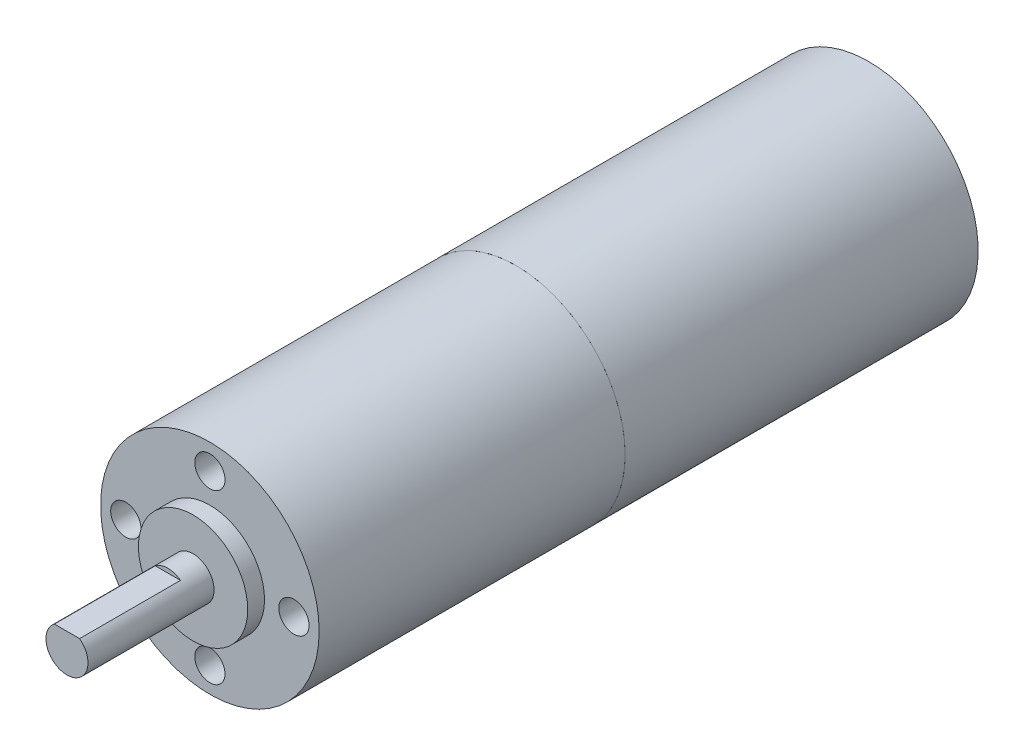
ISO-10303-21;
HEADER;
FILE_DESCRIPTION(('STEP AP214'),'2;1');
FILE_NAME('part.step','',(''),(''),'','','');
FILE_SCHEMA(('AUTOMOTIVE_DESIGN { 1 0 10303 214 1 1 1 1 }'));
ENDSEC;
DATA;
#1=APPLICATION_CONTEXT('core data for automotive mechanical design processes');
#2=APPLICATION_PROTOCOL_DEFINITION('international standard','automotive_design',2000,#1);
#3=PRODUCT_CONTEXT('',#1,'mechanical');
#4=PRODUCT('Part','Part','',(#3));
#5=PRODUCT_RELATED_PRODUCT_CATEGORY('part','',(#4));
#6=PRODUCT_DEFINITION_FORMATION('','',#4);
#7=PRODUCT_DEFINITION_CONTEXT('part definition',#1,'design');
#8=PRODUCT_DEFINITION('design','',#6,#7);
#9=PRODUCT_DEFINITION_SHAPE('','',#8);
#10=(LENGTH_UNIT() NAMED_UNIT(*) SI_UNIT(.MILLI.,.METRE.));
#11=(NAMED_UNIT(*) PLANE_ANGLE_UNIT() SI_UNIT($,.RADIAN.));
#12=(NAMED_UNIT(*) SI_UNIT($,.STERADIAN.) SOLID_ANGLE_UNIT());
#13=UNCERTAINTY_MEASURE_WITH_UNIT(LENGTH_MEASURE(1.E-05),#10,'distance_accuracy_value','');
#14=(GEOMETRIC_REPRESENTATION_CONTEXT(3) GLOBAL_UNCERTAINTY_ASSIGNED_CONTEXT((#13)) GLOBAL_UNIT_ASSIGNED_CONTEXT((#10,
#11,#12)) REPRESENTATION_CONTEXT('',''));
#15=CARTESIAN_POINT('',(0.,0.,0.));
#16=DIRECTION('',(0.,0.,1.));
#17=DIRECTION('',(1.,0.,0.));
#18=AXIS2_PLACEMENT_3D('',#15,#16,#17);
#19=CARTESIAN_POINT('',(0.,0.,-42.));
#20=DIRECTION('',(0.,0.,1.));
#21=DIRECTION('',(1.,0.,0.));
#22=AXIS2_PLACEMENT_3D('',#19,#20,#21);
#23=CYLINDRICAL_SURFACE('',#22,13.);
#24=CARTESIAN_POINT('',(0.,0.,-42.));
#25=DIRECTION('',(0.,0.,-1.));
#26=DIRECTION('',(-1.,0.,0.));
#27=AXIS2_PLACEMENT_3D('',#24,#25,#26);
#28=CIRCLE('',#27,13.);
#29=CARTESIAN_POINT('',(-13.,0.,-42.));
#30=VERTEX_POINT('',#29);
#31=EDGE_CURVE('E11',#30,#30,#28,.T.);
#32=ORIENTED_EDGE('',*,*,#31,.F.);
#33=EDGE_LOOP('',(#32));
#34=FACE_BOUND('',#33,.T.);
#35=CARTESIAN_POINT('',(0.,0.,0.));
#36=DIRECTION('',(0.,0.,-1.));
#37=DIRECTION('',(-1.,0.,0.));
#38=AXIS2_PLACEMENT_3D('',#35,#36,#37);
#39=CIRCLE('',#38,13.);
#40=CARTESIAN_POINT('',(-13.,0.,0.));
#41=VERTEX_POINT('',#40);
#42=EDGE_CURVE('E46',#41,#41,#39,.T.);
#43=ORIENTED_EDGE('',*,*,#42,.T.);
#44=EDGE_LOOP('',(#43));
#45=FACE_BOUND('',#44,.T.);
#46=ADVANCED_FACE('F43',(#34,#45),#23,.T.);
#47=CARTESIAN_POINT('',(0.,0.,-42.));
#48=DIRECTION('',(0.,0.,-1.));
#49=DIRECTION('',(-1.,0.,0.));
#50=AXIS2_PLACEMENT_3D('',#47,#48,#49);
#51=PLANE('',#50);
#52=ORIENTED_EDGE('',*,*,#31,.T.);
#53=EDGE_LOOP('',(#52));
#54=FACE_BOUND('',#53,.T.);
#55=ADVANCED_FACE('F58',(#54),#51,.T.);
#56=CARTESIAN_POINT('',(0.,0.,0.));
#57=DIRECTION('',(0.,0.,-1.));
#58=DIRECTION('',(-1.,0.,0.));
#59=AXIS2_PLACEMENT_3D('',#56,#57,#58);
#60=PLANE('',#59);
#61=ORIENTED_EDGE('',*,*,#42,.F.);
#62=EDGE_LOOP('',(#61));
#63=FACE_BOUND('',#62,.T.);
#64=ADVANCED_FACE('F56',(#63),#60,.F.);
#65=CLOSED_SHELL('',(#46,#55,#64));
#66=MANIFOLD_SOLID_BREP('B2',#65);
#67=CARTESIAN_POINT('',(0.,0.,39.4));
#68=DIRECTION('',(0.,0.,-1.));
#69=DIRECTION('',(-1.,0.,0.));
#70=AXIS2_PLACEMENT_3D('',#67,#68,#69);
#71=CYLINDRICAL_SURFACE('',#70,2.49680534345229);
#72=CARTESIAN_POINT('',(0.,0.,39.4));
#73=DIRECTION('',(0.,0.,1.));
#74=DIRECTION('',(1.,0.,0.));
#75=AXIS2_PLACEMENT_3D('',#72,#73,#74);
#76=CIRCLE('',#75,2.49680534345229);
#77=CARTESIAN_POINT('',(2.49680534345229,0.,39.4));
#78=VERTEX_POINT('',#77);
#79=EDGE_CURVE('E42',#78,#78,#76,.T.);
#80=ORIENTED_EDGE('',*,*,#79,.F.);
#81=EDGE_LOOP('',(#80));
#82=FACE_BOUND('',#81,.T.);
#83=CARTESIAN_POINT('',(0.,0.,36.4));
#84=DIRECTION('',(0.,0.,1.));
#85=DIRECTION('',(1.,0.,0.));
#86=AXIS2_PLACEMENT_3D('',#83,#84,#85);
#87=CIRCLE('',#86,2.49680534345229);
#88=CARTESIAN_POINT('',(2.49680534345229,0.,36.4));
#89=VERTEX_POINT('',#88);
#90=EDGE_CURVE('E95',#89,#89,#87,.T.);
#91=ORIENTED_EDGE('',*,*,#90,.T.);
#92=EDGE_LOOP('',(#91));
#93=FACE_BOUND('',#92,.T.);
#94=ADVANCED_FACE('F92',(#82,#93),#71,.T.);
#95=CARTESIAN_POINT('',(0.,0.,39.4));
#96=DIRECTION('',(0.,0.,1.));
#97=DIRECTION('',(1.,0.,0.));
#98=AXIS2_PLACEMENT_3D('',#95,#96,#97);
#99=PLANE('',#98);
#100=ORIENTED_EDGE('',*,*,#79,.T.);
#101=EDGE_LOOP('',(#100));
#102=FACE_BOUND('',#101,.T.);
#103=ADVANCED_FACE('F107',(#102),#99,.T.);
#104=CARTESIAN_POINT('',(0.,0.,36.4));
#105=DIRECTION('',(0.,0.,1.));
#106=DIRECTION('',(1.,0.,0.));
#107=AXIS2_PLACEMENT_3D('',#104,#105,#106);
#108=PLANE('',#107);
#109=ORIENTED_EDGE('',*,*,#90,.F.);
#110=EDGE_LOOP('',(#109));
#111=FACE_BOUND('',#110,.T.);
#112=ADVANCED_FACE('F105',(#111),#108,.F.);
#113=CLOSED_SHELL('',(#94,#103,#112));
#114=MANIFOLD_SOLID_BREP('B6_NOT_SHOWN',#113);
#115=CARTESIAN_POINT('',(0.,0.,36.4));
#116=DIRECTION('',(0.,0.,1.));
#117=DIRECTION('',(1.,0.,0.));
#118=AXIS2_PLACEMENT_3D('',#115,#116,#117);
#119=PLANE('',#118);
#120=CARTESIAN_POINT('',(0.,10.,36.4));
#121=DIRECTION('',(0.,0.,1.));
#122=DIRECTION('',(1.,0.,0.));
#123=AXIS2_PLACEMENT_3D('',#120,#121,#122);
#124=CIRCLE('',#123,1.8);
#125=CARTESIAN_POINT('',(1.8,10.,36.4));
#126=VERTEX_POINT('',#125);
#127=EDGE_CURVE('E204',#126,#126,#124,.T.);
#128=ORIENTED_EDGE('',*,*,#127,.F.);
#129=EDGE_LOOP('',(#128));
#130=FACE_BOUND('',#129,.T.);
#131=CARTESIAN_POINT('',(-10.,0.,36.4));
#132=DIRECTION('',(0.,0.,1.));
#133=DIRECTION('',(1.,0.,0.));
#134=AXIS2_PLACEMENT_3D('',#131,#132,#133);
#135=CIRCLE('',#134,1.8);
#136=CARTESIAN_POINT('',(-8.2,0.,36.4));
#137=VERTEX_POINT('',#136);
#138=EDGE_CURVE('E198',#137,#137,#135,.T.);
#139=ORIENTED_EDGE('',*,*,#138,.F.);
#140=EDGE_LOOP('',(#139));
#141=FACE_BOUND('',#140,.T.);
#142=CARTESIAN_POINT('',(0.,-10.,36.4));
#143=DIRECTION('',(0.,0.,1.));
#144=DIRECTION('',(1.,0.,0.));
#145=AXIS2_PLACEMENT_3D('',#142,#143,#144);
#146=CIRCLE('',#145,1.8);
#147=CARTESIAN_POINT('',(1.8,-10.,36.4));
#148=VERTEX_POINT('',#147);
#149=EDGE_CURVE('E192',#148,#148,#146,.T.);
#150=ORIENTED_EDGE('',*,*,#149,.F.);
#151=EDGE_LOOP('',(#150));
#152=FACE_BOUND('',#151,.T.);
#153=CARTESIAN_POINT('',(10.,0.,36.4));
#154=DIRECTION('',(0.,0.,1.));
#155=DIRECTION('',(1.,0.,0.));
#156=AXIS2_PLACEMENT_3D('',#153,#154,#155);
#157=CIRCLE('',#156,1.8);
#158=CARTESIAN_POINT('',(11.8,0.,36.4));
#159=VERTEX_POINT('',#158);
#160=EDGE_CURVE('E186',#159,#159,#157,.T.);
#161=ORIENTED_EDGE('',*,*,#160,.F.);
#162=EDGE_LOOP('',(#161));
#163=FACE_BOUND('',#162,.T.);
#164=CARTESIAN_POINT('',(0.,0.,36.4));
#165=DIRECTION('',(0.,0.,1.));
#166=DIRECTION('',(1.,0.,0.));
#167=AXIS2_PLACEMENT_3D('',#164,#165,#166);
#168=CIRCLE('',#167,13.);
#169=CARTESIAN_POINT('',(13.,0.,36.4));
#170=VERTEX_POINT('',#169);
#171=EDGE_CURVE('E90',#170,#170,#168,.T.);
#172=ORIENTED_EDGE('',*,*,#171,.T.);
#173=EDGE_LOOP('',(#172));
#174=FACE_BOUND('',#173,.T.);
#175=CARTESIAN_POINT('',(0.,0.,36.4));
#176=DIRECTION('',(0.,0.,1.));
#177=DIRECTION('',(1.,0.,0.));
#178=AXIS2_PLACEMENT_3D('',#175,#176,#177);
#179=CIRCLE('',#178,6.5);
#180=CARTESIAN_POINT('',(6.5,0.,36.4));
#181=VERTEX_POINT('',#180);
#182=EDGE_CURVE('E177',#181,#181,#179,.T.);
#183=ORIENTED_EDGE('',*,*,#182,.F.);
#184=EDGE_LOOP('',(#183));
#185=FACE_BOUND('',#184,.T.);
#186=ADVANCED_FACE('F132',(#130,#141,#152,#163,#174,#185),#119,.T.);
#187=CARTESIAN_POINT('',(0.,0.,36.4));
#188=DIRECTION('',(0.,0.,-1.));
#189=DIRECTION('',(-1.,0.,0.));
#190=AXIS2_PLACEMENT_3D('',#187,#188,#189);
#191=CYLINDRICAL_SURFACE('',#190,13.);
#192=ORIENTED_EDGE('',*,*,#171,.F.);
#193=EDGE_LOOP('',(#192));
#194=FACE_BOUND('',#193,.T.);
#195=CARTESIAN_POINT('',(0.,0.,0.));
#196=DIRECTION('',(0.,0.,1.));
#197=DIRECTION('',(1.,0.,0.));
#198=AXIS2_PLACEMENT_3D('',#195,#196,#197);
#199=CIRCLE('',#198,13.);
#200=CARTESIAN_POINT('',(13.,0.,0.));
#201=VERTEX_POINT('',#200);
#202=EDGE_CURVE('E136',#201,#201,#199,.T.);
#203=ORIENTED_EDGE('',*,*,#202,.T.);
#204=EDGE_LOOP('',(#203));
#205=FACE_BOUND('',#204,.T.);
#206=ADVANCED_FACE('F134',(#194,#205),#191,.T.);
#207=CARTESIAN_POINT('',(0.,0.,0.));
#208=DIRECTION('',(0.,0.,1.));
#209=DIRECTION('',(1.,0.,0.));
#210=AXIS2_PLACEMENT_3D('',#207,#208,#209);
#211=PLANE('',#210);
#212=ORIENTED_EDGE('',*,*,#202,.F.);
#213=EDGE_LOOP('',(#212));
#214=FACE_BOUND('',#213,.T.);
#215=ADVANCED_FACE('F226',(#214),#211,.F.);
#216=CARTESIAN_POINT('',(0.,0.,38.4));
#217=DIRECTION('',(0.,0.,1.));
#218=DIRECTION('',(1.,0.,0.));
#219=AXIS2_PLACEMENT_3D('',#216,#217,#218);
#220=PLANE('',#219);
#221=CARTESIAN_POINT('',(0.,0.,38.4));
#222=DIRECTION('',(0.,0.,1.));
#223=DIRECTION('',(1.,0.,0.));
#224=AXIS2_PLACEMENT_3D('',#221,#222,#223);
#225=CIRCLE('',#224,6.5);
#226=CARTESIAN_POINT('',(6.5,0.,38.4));
#227=VERTEX_POINT('',#226);
#228=EDGE_CURVE('E173',#227,#227,#225,.T.);
#229=ORIENTED_EDGE('',*,*,#228,.T.);
#230=EDGE_LOOP('',(#229));
#231=FACE_BOUND('',#230,.T.);
#232=CARTESIAN_POINT('',(0.,0.,38.4));
#233=DIRECTION('',(0.,0.,1.));
#234=DIRECTION('',(1.,0.,0.));
#235=AXIS2_PLACEMENT_3D('',#232,#233,#234);
#236=CIRCLE('',#235,2.5);
#237=CARTESIAN_POINT('',(2.5,0.,38.4));
#238=VERTEX_POINT('',#237);
#239=EDGE_CURVE('E181',#238,#238,#236,.T.);
#240=ORIENTED_EDGE('',*,*,#239,.F.);
#241=EDGE_LOOP('',(#240));
#242=FACE_BOUND('',#241,.T.);
#243=ADVANCED_FACE('F233',(#231,#242),#220,.T.);
#244=CARTESIAN_POINT('',(0.,0.,38.4));
#245=DIRECTION('',(0.,0.,-1.));
#246=DIRECTION('',(-1.,0.,0.));
#247=AXIS2_PLACEMENT_3D('',#244,#245,#246);
#248=CYLINDRICAL_SURFACE('',#247,6.5);
#249=ORIENTED_EDGE('',*,*,#228,.F.);
#250=EDGE_LOOP('',(#249));
#251=FACE_BOUND('',#250,.T.);
#252=ORIENTED_EDGE('',*,*,#182,.T.);
#253=EDGE_LOOP('',(#252));
#254=FACE_BOUND('',#253,.T.);
#255=ADVANCED_FACE('F238',(#251,#254),#248,.T.);
#256=CARTESIAN_POINT('',(0.,0.,53.4));
#257=DIRECTION('',(0.,0.,1.));
#258=DIRECTION('',(1.,0.,0.));
#259=AXIS2_PLACEMENT_3D('',#256,#257,#258);
#260=PLANE('',#259);
#261=DIRECTION('',(1.,0.,0.));
#262=VECTOR('',#261,1.);
#263=CARTESIAN_POINT('',(0.,2.,53.4));
#264=LINE('',#263,#262);
#265=CARTESIAN_POINT('',(-1.5,2.,53.4));
#266=VERTEX_POINT('',#265);
#267=CARTESIAN_POINT('',(1.5,2.,53.4));
#268=VERTEX_POINT('',#267);
#269=EDGE_CURVE('E157',#266,#268,#264,.T.);
#270=ORIENTED_EDGE('',*,*,#269,.F.);
#271=CARTESIAN_POINT('',(0.,0.,53.4));
#272=DIRECTION('',(0.,0.,1.));
#273=DIRECTION('',(1.,0.,0.));
#274=AXIS2_PLACEMENT_3D('',#271,#272,#273);
#275=CIRCLE('',#274,2.5);
#276=EDGE_CURVE('E169',#266,#268,#275,.T.);
#277=ORIENTED_EDGE('',*,*,#276,.T.);
#278=EDGE_LOOP('',(#270,#277));
#279=FACE_BOUND('',#278,.T.);
#280=ADVANCED_FACE('F172',(#279),#260,.T.);
#281=CARTESIAN_POINT('',(0.,0.,53.4));
#282=DIRECTION('',(0.,0.,-1.));
#283=DIRECTION('',(-1.,0.,0.));
#284=AXIS2_PLACEMENT_3D('',#281,#282,#283);
#285=CYLINDRICAL_SURFACE('',#284,2.5);
#286=ORIENTED_EDGE('',*,*,#276,.F.);
#287=DIRECTION('',(0.,0.,1.));
#288=VECTOR('',#287,1.);
#289=CARTESIAN_POINT('',(-1.5,2.,41.4));
#290=LINE('',#289,#288);
#291=CARTESIAN_POINT('',(-1.5,2.,41.4));
#292=VERTEX_POINT('',#291);
#293=EDGE_CURVE('E160',#292,#266,#290,.T.);
#294=ORIENTED_EDGE('',*,*,#293,.F.);
#295=CARTESIAN_POINT('',(0.,0.,41.4));
#296=DIRECTION('',(0.,0.,1.));
#297=DIRECTION('',(-1.,0.,0.));
#298=AXIS2_PLACEMENT_3D('',#295,#296,#297);
#299=CIRCLE('',#298,2.5);
#300=CARTESIAN_POINT('',(1.5,2.,41.4));
#301=VERTEX_POINT('',#300);
#302=EDGE_CURVE('E170',#301,#292,#299,.T.);
#303=ORIENTED_EDGE('',*,*,#302,.F.);
#304=DIRECTION('',(0.,0.,1.));
#305=VECTOR('',#304,1.);
#306=CARTESIAN_POINT('',(1.5,2.,41.4));
#307=LINE('',#306,#305);
#308=EDGE_CURVE('E147',#301,#268,#307,.T.);
#309=ORIENTED_EDGE('',*,*,#308,.T.);
#310=EDGE_LOOP('',(#286,#294,#303,#309));
#311=FACE_BOUND('',#310,.T.);
#312=ORIENTED_EDGE('',*,*,#239,.T.);
#313=EDGE_LOOP('',(#312));
#314=FACE_BOUND('',#313,.T.);
#315=ADVANCED_FACE('F167',(#311,#314),#285,.T.);
#316=CARTESIAN_POINT('',(10.,0.,32.4));
#317=DIRECTION('',(0.,0.,1.));
#318=DIRECTION('',(1.,0.,0.));
#319=AXIS2_PLACEMENT_3D('',#316,#317,#318);
#320=CYLINDRICAL_SURFACE('',#319,1.8);
#321=CARTESIAN_POINT('',(10.,0.,32.4));
#322=DIRECTION('',(0.,0.,1.));
#323=DIRECTION('',(1.,0.,0.));
#324=AXIS2_PLACEMENT_3D('',#321,#322,#323);
#325=CIRCLE('',#324,1.8);
#326=CARTESIAN_POINT('',(11.8,0.,32.4));
#327=VERTEX_POINT('',#326);
#328=EDGE_CURVE('E189',#327,#327,#325,.T.);
#329=ORIENTED_EDGE('',*,*,#328,.F.);
#330=EDGE_LOOP('',(#329));
#331=FACE_BOUND('',#330,.T.);
#332=ORIENTED_EDGE('',*,*,#160,.T.);
#333=EDGE_LOOP('',(#332));
#334=FACE_BOUND('',#333,.T.);
#335=ADVANCED_FACE('F250',(#331,#334),#320,.F.);
#336=CARTESIAN_POINT('',(10.,0.,32.4));
#337=DIRECTION('',(0.,0.,1.));
#338=DIRECTION('',(1.,0.,0.));
#339=AXIS2_PLACEMENT_3D('',#336,#337,#338);
#340=PLANE('',#339);
#341=ORIENTED_EDGE('',*,*,#328,.T.);
#342=EDGE_LOOP('',(#341));
#343=FACE_BOUND('',#342,.T.);
#344=ADVANCED_FACE('F259',(#343),#340,.T.);
#345=CARTESIAN_POINT('',(0.,-10.,32.4));
#346=DIRECTION('',(0.,0.,1.));
#347=DIRECTION('',(1.,0.,0.));
#348=AXIS2_PLACEMENT_3D('',#345,#346,#347);
#349=CYLINDRICAL_SURFACE('',#348,1.8);
#350=CARTESIAN_POINT('',(0.,-10.,32.4));
#351=DIRECTION('',(0.,0.,1.));
#352=DIRECTION('',(1.,0.,0.));
#353=AXIS2_PLACEMENT_3D('',#350,#351,#352);
#354=CIRCLE('',#353,1.8);
#355=CARTESIAN_POINT('',(1.8,-10.,32.4));
#356=VERTEX_POINT('',#355);
#357=EDGE_CURVE('E195',#356,#356,#354,.T.);
#358=ORIENTED_EDGE('',*,*,#357,.F.);
#359=EDGE_LOOP('',(#358));
#360=FACE_BOUND('',#359,.T.);
#361=ORIENTED_EDGE('',*,*,#149,.T.);
#362=EDGE_LOOP('',(#361));
#363=FACE_BOUND('',#362,.T.);
#364=ADVANCED_FACE('F264',(#360,#363),#349,.F.);
#365=CARTESIAN_POINT('',(0.,-10.,32.4));
#366=DIRECTION('',(0.,0.,1.));
#367=DIRECTION('',(1.,0.,0.));
#368=AXIS2_PLACEMENT_3D('',#365,#366,#367);
#369=PLANE('',#368);
#370=ORIENTED_EDGE('',*,*,#357,.T.);
#371=EDGE_LOOP('',(#370));
#372=FACE_BOUND('',#371,.T.);
#373=ADVANCED_FACE('F278',(#372),#369,.T.);
#374=CARTESIAN_POINT('',(-10.,0.,32.4));
#375=DIRECTION('',(0.,0.,1.));
#376=DIRECTION('',(1.,0.,0.));
#377=AXIS2_PLACEMENT_3D('',#374,#375,#376);
#378=CYLINDRICAL_SURFACE('',#377,1.8);
#379=CARTESIAN_POINT('',(-10.,0.,32.4));
#380=DIRECTION('',(0.,0.,1.));
#381=DIRECTION('',(1.,0.,0.));
#382=AXIS2_PLACEMENT_3D('',#379,#380,#381);
#383=CIRCLE('',#382,1.8);
#384=CARTESIAN_POINT('',(-8.2,0.,32.4));
#385=VERTEX_POINT('',#384);
#386=EDGE_CURVE('E201',#385,#385,#383,.T.);
#387=ORIENTED_EDGE('',*,*,#386,.F.);
#388=EDGE_LOOP('',(#387));
#389=FACE_BOUND('',#388,.T.);
#390=ORIENTED_EDGE('',*,*,#138,.T.);
#391=EDGE_LOOP('',(#390));
#392=FACE_BOUND('',#391,.T.);
#393=ADVANCED_FACE('F284',(#389,#392),#378,.F.);
#394=CARTESIAN_POINT('',(-10.,0.,32.4));
#395=DIRECTION('',(0.,0.,1.));
#396=DIRECTION('',(1.,0.,0.));
#397=AXIS2_PLACEMENT_3D('',#394,#395,#396);
#398=PLANE('',#397);
#399=ORIENTED_EDGE('',*,*,#386,.T.);
#400=EDGE_LOOP('',(#399));
#401=FACE_BOUND('',#400,.T.);
#402=ADVANCED_FACE('F288',(#401),#398,.T.);
#403=CARTESIAN_POINT('',(0.,10.,32.4));
#404=DIRECTION('',(0.,0.,1.));
#405=DIRECTION('',(1.,0.,0.));
#406=AXIS2_PLACEMENT_3D('',#403,#404,#405);
#407=CYLINDRICAL_SURFACE('',#406,1.8);
#408=CARTESIAN_POINT('',(0.,10.,32.4));
#409=DIRECTION('',(0.,0.,1.));
#410=DIRECTION('',(1.,0.,0.));
#411=AXIS2_PLACEMENT_3D('',#408,#409,#410);
#412=CIRCLE('',#411,1.8);
#413=CARTESIAN_POINT('',(1.8,10.,32.4));
#414=VERTEX_POINT('',#413);
#415=EDGE_CURVE('E185',#414,#414,#412,.T.);
#416=ORIENTED_EDGE('',*,*,#415,.F.);
#417=EDGE_LOOP('',(#416));
#418=FACE_BOUND('',#417,.T.);
#419=ORIENTED_EDGE('',*,*,#127,.T.);
#420=EDGE_LOOP('',(#419));
#421=FACE_BOUND('',#420,.T.);
#422=ADVANCED_FACE('F292',(#418,#421),#407,.F.);
#423=CARTESIAN_POINT('',(0.,10.,32.4));
#424=DIRECTION('',(0.,0.,1.));
#425=DIRECTION('',(1.,0.,0.));
#426=AXIS2_PLACEMENT_3D('',#423,#424,#425);
#427=PLANE('',#426);
#428=ORIENTED_EDGE('',*,*,#415,.T.);
#429=EDGE_LOOP('',(#428));
#430=FACE_BOUND('',#429,.T.);
#431=ADVANCED_FACE('F218',(#430),#427,.T.);
#432=CARTESIAN_POINT('',(0.,2.,41.4));
#433=DIRECTION('',(0.,-1.,0.));
#434=DIRECTION('',(0.,0.,-1.));
#435=AXIS2_PLACEMENT_3D('',#432,#433,#434);
#436=PLANE('',#435);
#437=ORIENTED_EDGE('',*,*,#269,.T.);
#438=ORIENTED_EDGE('',*,*,#308,.F.);
#439=DIRECTION('',(1.,0.,0.));
#440=VECTOR('',#439,1.);
#441=CARTESIAN_POINT('',(0.,2.,41.4));
#442=LINE('',#441,#440);
#443=EDGE_CURVE('E152',#292,#301,#442,.T.);
#444=ORIENTED_EDGE('',*,*,#443,.F.);
#445=ORIENTED_EDGE('',*,*,#293,.T.);
#446=EDGE_LOOP('',(#437,#438,#444,#445));
#447=FACE_BOUND('',#446,.T.);
#448=ADVANCED_FACE('F158',(#447),#436,.F.);
#449=CARTESIAN_POINT('',(0.,0.,41.4));
#450=DIRECTION('',(0.,0.,-1.));
#451=DIRECTION('',(-1.,0.,0.));
#452=AXIS2_PLACEMENT_3D('',#449,#450,#451);
#453=PLANE('',#452);
#454=ORIENTED_EDGE('',*,*,#443,.T.);
#455=ORIENTED_EDGE('',*,*,#302,.T.);
#456=EDGE_LOOP('',(#454,#455));
#457=FACE_BOUND('',#456,.T.);
#458=ADVANCED_FACE('F212',(#457),#453,.F.);
#459=CLOSED_SHELL('',(#186,#206,#215,#243,#255,#280,#315,#335,#344,#364,#373,#393,#402,#422,
#431,#448,#458));
#460=MANIFOLD_SOLID_BREP('B37',#459);
#461=ADVANCED_BREP_SHAPE_REPRESENTATION('',(#18,#66,#114,#460),#14);
#462=SHAPE_DEFINITION_REPRESENTATION(#9,#461);
ENDSEC;
END-ISO-10303-21;
